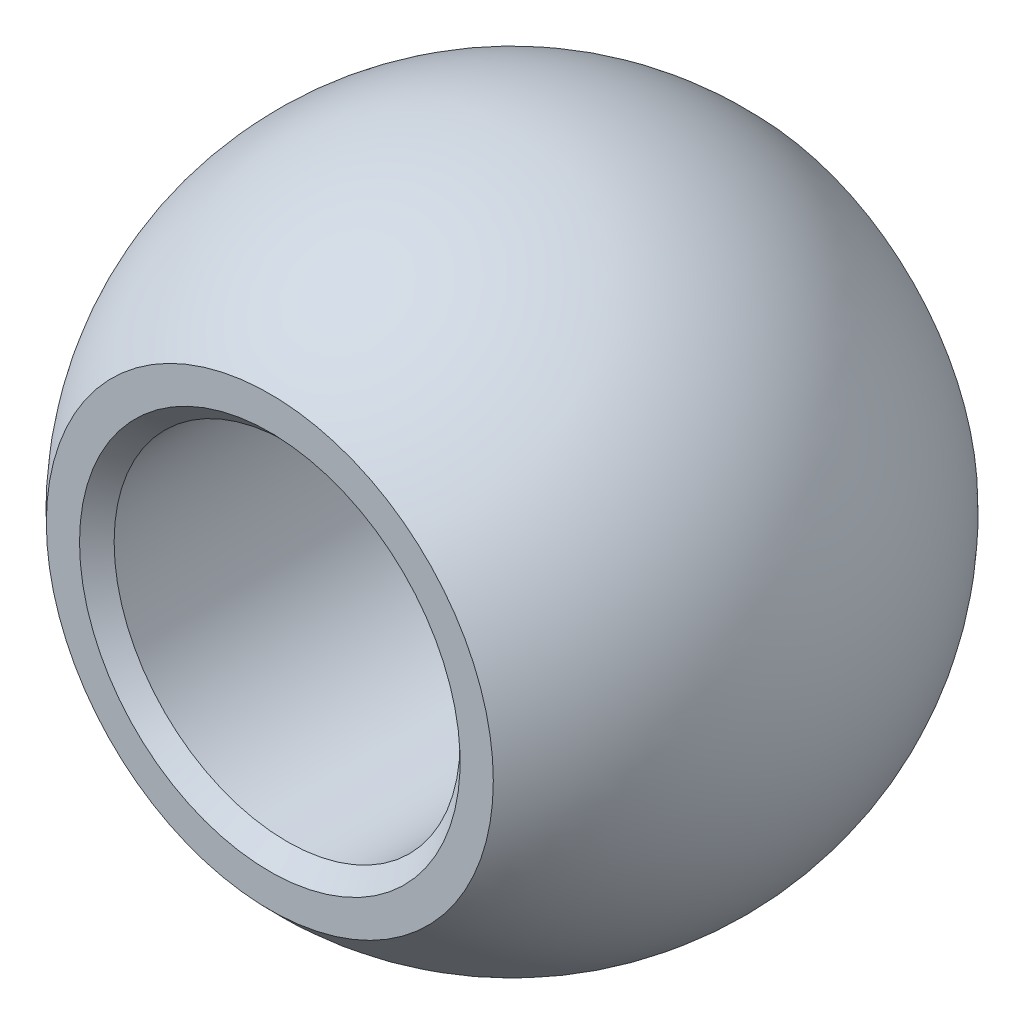
ISO-10303-21;
HEADER;
FILE_DESCRIPTION(('STEP AP214'),'2;1');
FILE_NAME('part.step','',(''),(''),'','','');
FILE_SCHEMA(('AUTOMOTIVE_DESIGN { 1 0 10303 214 1 1 1 1 }'));
ENDSEC;
DATA;
#1=APPLICATION_CONTEXT('core data for automotive mechanical design processes');
#2=APPLICATION_PROTOCOL_DEFINITION('international standard','automotive_design',2000,#1);
#3=PRODUCT_CONTEXT('',#1,'mechanical');
#4=PRODUCT('Part','Part','',(#3));
#5=PRODUCT_RELATED_PRODUCT_CATEGORY('part','',(#4));
#6=PRODUCT_DEFINITION_FORMATION('','',#4);
#7=PRODUCT_DEFINITION_CONTEXT('part definition',#1,'design');
#8=PRODUCT_DEFINITION('design','',#6,#7);
#9=PRODUCT_DEFINITION_SHAPE('','',#8);
#10=(LENGTH_UNIT() NAMED_UNIT(*) SI_UNIT(.MILLI.,.METRE.));
#11=(NAMED_UNIT(*) PLANE_ANGLE_UNIT() SI_UNIT($,.RADIAN.));
#12=(NAMED_UNIT(*) SI_UNIT($,.STERADIAN.) SOLID_ANGLE_UNIT());
#13=UNCERTAINTY_MEASURE_WITH_UNIT(LENGTH_MEASURE(1.E-05),#10,'distance_accuracy_value','');
#14=(GEOMETRIC_REPRESENTATION_CONTEXT(3) GLOBAL_UNCERTAINTY_ASSIGNED_CONTEXT((#13)) GLOBAL_UNIT_ASSIGNED_CONTEXT((#10,
#11,#12)) REPRESENTATION_CONTEXT('',''));
#15=CARTESIAN_POINT('',(0.,0.,0.));
#16=DIRECTION('',(0.,0.,1.));
#17=DIRECTION('',(1.,0.,0.));
#18=AXIS2_PLACEMENT_3D('',#15,#16,#17);
#19=CARTESIAN_POINT('',(0.,0.,0.));
#20=DIRECTION('',(0.,1.,0.));
#21=DIRECTION('',(1.,0.,0.));
#22=AXIS2_PLACEMENT_3D('',#19,#20,#21);
#23=SPHERICAL_SURFACE('',#22,9.525);
#24=CARTESIAN_POINT('',(0.,0.,0.));
#25=DIRECTION('',(0.,0.,1.));
#26=DIRECTION('',(1.,0.,0.));
#27=AXIS2_PLACEMENT_3D('',#24,#25,#26);
#28=SPHERICAL_SURFACE('',#27,9.525);
#29=CARTESIAN_POINT('',(0.,0.,-7.));
#30=DIRECTION('',(0.,0.,1.));
#31=DIRECTION('',(1.,0.,0.));
#32=AXIS2_PLACEMENT_3D('',#29,#30,#31);
#33=CIRCLE('',#32,6.45953752214506);
#34=CARTESIAN_POINT('',(6.45953752214506,0.,-7.));
#35=VERTEX_POINT('',#34);
#36=EDGE_CURVE('E66',#35,#35,#33,.F.);
#37=ORIENTED_EDGE('',*,*,#36,.F.);
#38=EDGE_LOOP('',(#37));
#39=FACE_BOUND('',#38,.T.);
#40=CARTESIAN_POINT('',(0.,0.,7.));
#41=DIRECTION('',(0.,0.,-1.));
#42=DIRECTION('',(-1.,0.,0.));
#43=AXIS2_PLACEMENT_3D('',#40,#41,#42);
#44=CIRCLE('',#43,6.45953752214506);
#45=CARTESIAN_POINT('',(-6.45953752214506,0.,7.));
#46=VERTEX_POINT('',#45);
#47=EDGE_CURVE('E69',#46,#46,#44,.F.);
#48=ORIENTED_EDGE('',*,*,#47,.F.);
#49=EDGE_LOOP('',(#48));
#50=FACE_BOUND('',#49,.T.);
#51=ADVANCED_FACE('F40',(#39,#50),#28,.T.);
#52=CARTESIAN_POINT('',(-9.525,-9.525,7.));
#53=DIRECTION('',(0.,0.,-1.));
#54=DIRECTION('',(-1.,0.,0.));
#55=AXIS2_PLACEMENT_3D('',#52,#53,#54);
#56=PLANE('',#55);
#57=CARTESIAN_POINT('',(0.,0.,7.));
#58=DIRECTION('',(0.,0.,-1.));
#59=DIRECTION('',(-1.,0.,0.));
#60=AXIS2_PLACEMENT_3D('',#57,#58,#59);
#61=CIRCLE('',#60,5.49999999999999);
#62=CARTESIAN_POINT('',(-5.49999999999999,0.,7.));
#63=VERTEX_POINT('',#62);
#64=EDGE_CURVE('E10',#63,#63,#61,.T.);
#65=ORIENTED_EDGE('',*,*,#64,.T.);
#66=EDGE_LOOP('',(#65));
#67=FACE_BOUND('',#66,.T.);
#68=ORIENTED_EDGE('',*,*,#47,.T.);
#69=EDGE_LOOP('',(#68));
#70=FACE_BOUND('',#69,.T.);
#71=ADVANCED_FACE('F74',(#67,#70),#56,.F.);
#72=CARTESIAN_POINT('',(-9.525,-9.525,-7.));
#73=DIRECTION('',(0.,0.,1.));
#74=DIRECTION('',(1.,0.,0.));
#75=AXIS2_PLACEMENT_3D('',#72,#73,#74);
#76=PLANE('',#75);
#77=CARTESIAN_POINT('',(0.,0.,-7.));
#78=DIRECTION('',(0.,0.,1.));
#79=DIRECTION('',(1.,0.,0.));
#80=AXIS2_PLACEMENT_3D('',#77,#78,#79);
#81=CIRCLE('',#80,5.5);
#82=CARTESIAN_POINT('',(5.5,0.,-7.));
#83=VERTEX_POINT('',#82);
#84=EDGE_CURVE('E61',#83,#83,#81,.T.);
#85=ORIENTED_EDGE('',*,*,#84,.T.);
#86=EDGE_LOOP('',(#85));
#87=FACE_BOUND('',#86,.T.);
#88=ORIENTED_EDGE('',*,*,#36,.T.);
#89=EDGE_LOOP('',(#88));
#90=FACE_BOUND('',#89,.T.);
#91=ADVANCED_FACE('F82',(#87,#90),#76,.F.);
#92=CARTESIAN_POINT('',(0.,0.,-7.));
#93=DIRECTION('',(0.,0.,1.));
#94=DIRECTION('',(1.,0.,0.));
#95=AXIS2_PLACEMENT_3D('',#92,#93,#94);
#96=CYLINDRICAL_SURFACE('',#95,5.);
#97=CARTESIAN_POINT('',(0.,0.,-6.5));
#98=DIRECTION('',(0.,0.,1.));
#99=DIRECTION('',(1.,0.,0.));
#100=AXIS2_PLACEMENT_3D('',#97,#98,#99);
#101=CIRCLE('',#100,5.);
#102=CARTESIAN_POINT('',(5.,0.,-6.5));
#103=VERTEX_POINT('',#102);
#104=EDGE_CURVE('E49',#103,#103,#101,.F.);
#105=ORIENTED_EDGE('',*,*,#104,.T.);
#106=EDGE_LOOP('',(#105));
#107=FACE_BOUND('',#106,.T.);
#108=CARTESIAN_POINT('',(0.,0.,6.50000000000001));
#109=DIRECTION('',(0.,0.,-1.));
#110=DIRECTION('',(-1.,0.,0.));
#111=AXIS2_PLACEMENT_3D('',#108,#109,#110);
#112=CIRCLE('',#111,5.);
#113=CARTESIAN_POINT('',(-5.,0.,6.50000000000001));
#114=VERTEX_POINT('',#113);
#115=EDGE_CURVE('E56',#114,#114,#112,.F.);
#116=ORIENTED_EDGE('',*,*,#115,.T.);
#117=EDGE_LOOP('',(#116));
#118=FACE_BOUND('',#117,.T.);
#119=ADVANCED_FACE('F91',(#107,#118),#96,.F.);
#120=CARTESIAN_POINT('',(0.,0.,-7.));
#121=DIRECTION('',(0.,0.,-1.));
#122=DIRECTION('',(-1.,0.,0.));
#123=AXIS2_PLACEMENT_3D('',#120,#121,#122);
#124=CONICAL_SURFACE('',#123,5.5,0.785398163397445);
#125=ORIENTED_EDGE('',*,*,#104,.F.);
#126=EDGE_LOOP('',(#125));
#127=FACE_BOUND('',#126,.T.);
#128=ORIENTED_EDGE('',*,*,#84,.F.);
#129=EDGE_LOOP('',(#128));
#130=FACE_BOUND('',#129,.T.);
#131=ADVANCED_FACE('F87',(#127,#130),#124,.F.);
#132=CARTESIAN_POINT('',(0.,0.,6.50000000000001));
#133=DIRECTION('',(0.,0.,1.));
#134=DIRECTION('',(1.,0.,0.));
#135=AXIS2_PLACEMENT_3D('',#132,#133,#134);
#136=CONICAL_SURFACE('',#135,5.,0.785398163397451);
#137=ORIENTED_EDGE('',*,*,#64,.F.);
#138=EDGE_LOOP('',(#137));
#139=FACE_BOUND('',#138,.T.);
#140=ORIENTED_EDGE('',*,*,#115,.F.);
#141=EDGE_LOOP('',(#140));
#142=FACE_BOUND('',#141,.T.);
#143=ADVANCED_FACE('F43',(#139,#142),#136,.F.);
#144=CLOSED_SHELL('',(#51,#71,#91,#119,#131,#143));
#145=MANIFOLD_SOLID_BREP('B2',#144);
#146=ADVANCED_BREP_SHAPE_REPRESENTATION('',(#18,#145),#14);
#147=SHAPE_DEFINITION_REPRESENTATION(#9,#146);
ENDSEC;
END-ISO-10303-21;
